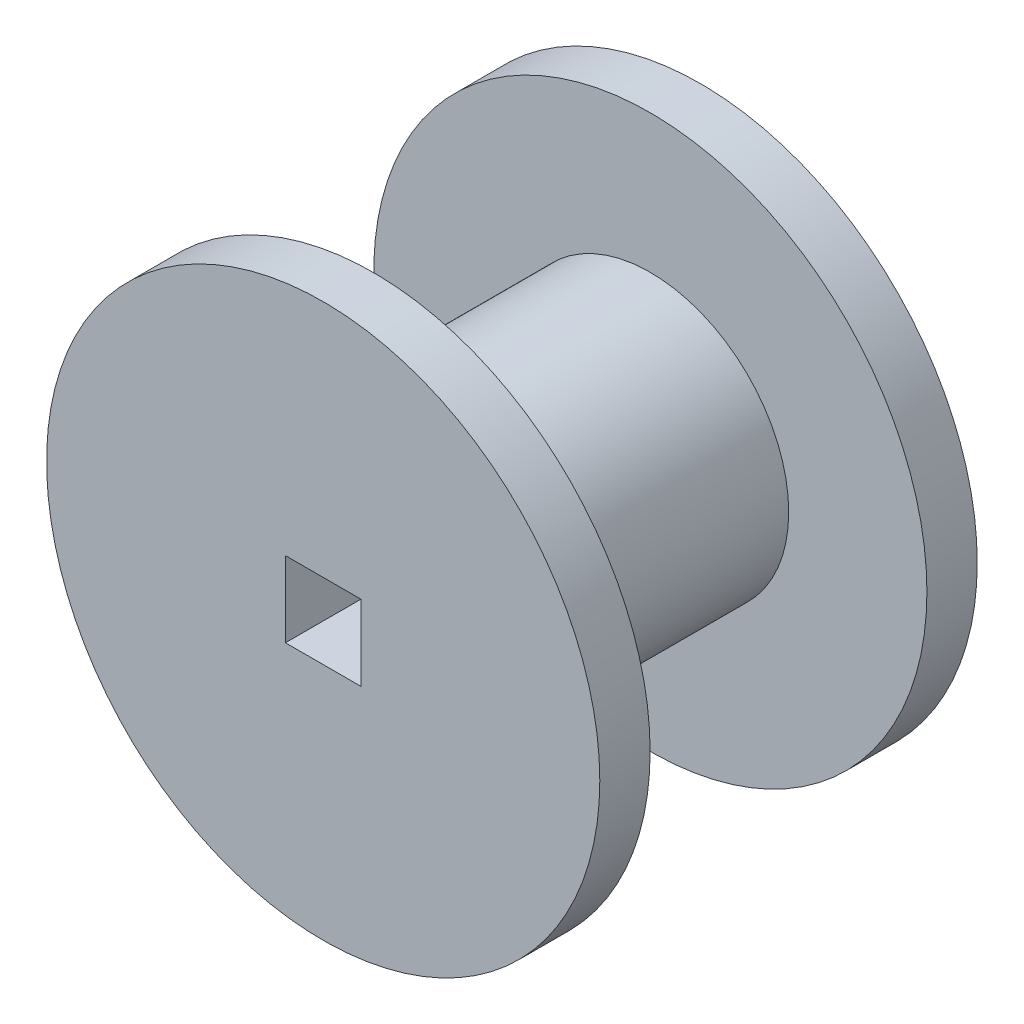
ISO-10303-21;
HEADER;
FILE_DESCRIPTION(('STEP AP214'),'2;1');
FILE_NAME('part.step','',(''),(''),'','','');
FILE_SCHEMA(('AUTOMOTIVE_DESIGN { 1 0 10303 214 1 1 1 1 }'));
ENDSEC;
DATA;
#1=APPLICATION_CONTEXT('core data for automotive mechanical design processes');
#2=APPLICATION_PROTOCOL_DEFINITION('international standard','automotive_design',2000,#1);
#3=PRODUCT_CONTEXT('',#1,'mechanical');
#4=PRODUCT('Part','Part','',(#3));
#5=PRODUCT_RELATED_PRODUCT_CATEGORY('part','',(#4));
#6=PRODUCT_DEFINITION_FORMATION('','',#4);
#7=PRODUCT_DEFINITION_CONTEXT('part definition',#1,'design');
#8=PRODUCT_DEFINITION('design','',#6,#7);
#9=PRODUCT_DEFINITION_SHAPE('','',#8);
#10=(LENGTH_UNIT() NAMED_UNIT(*) SI_UNIT(.MILLI.,.METRE.));
#11=(NAMED_UNIT(*) PLANE_ANGLE_UNIT() SI_UNIT($,.RADIAN.));
#12=(NAMED_UNIT(*) SI_UNIT($,.STERADIAN.) SOLID_ANGLE_UNIT());
#13=UNCERTAINTY_MEASURE_WITH_UNIT(LENGTH_MEASURE(1.E-05),#10,'distance_accuracy_value','');
#14=(GEOMETRIC_REPRESENTATION_CONTEXT(3) GLOBAL_UNCERTAINTY_ASSIGNED_CONTEXT((#13)) GLOBAL_UNIT_ASSIGNED_CONTEXT((#10,
#11,#12)) REPRESENTATION_CONTEXT('',''));
#15=CARTESIAN_POINT('',(0.,0.,0.));
#16=DIRECTION('',(0.,0.,1.));
#17=DIRECTION('',(1.,0.,0.));
#18=AXIS2_PLACEMENT_3D('',#15,#16,#17);
#19=CARTESIAN_POINT('',(0.,0.,2.));
#20=DIRECTION('',(0.,0.,1.));
#21=DIRECTION('',(1.,0.,0.));
#22=AXIS2_PLACEMENT_3D('',#19,#20,#21);
#23=PLANE('',#22);
#24=CARTESIAN_POINT('',(0.,0.,2.));
#25=DIRECTION('',(0.,0.,1.));
#26=DIRECTION('',(1.,0.,0.));
#27=AXIS2_PLACEMENT_3D('',#24,#25,#26);
#28=CIRCLE('',#27,10.99264862138);
#29=CARTESIAN_POINT('',(10.99264862138,0.,2.));
#30=VERTEX_POINT('',#29);
#31=EDGE_CURVE('E11',#30,#30,#28,.T.);
#32=ORIENTED_EDGE('',*,*,#31,.T.);
#33=EDGE_LOOP('',(#32));
#34=FACE_BOUND('',#33,.T.);
#35=CARTESIAN_POINT('',(0.,0.,2.));
#36=DIRECTION('',(0.,0.,1.));
#37=DIRECTION('',(1.,0.,0.));
#38=AXIS2_PLACEMENT_3D('',#35,#36,#37);
#39=CIRCLE('',#38,5.5);
#40=CARTESIAN_POINT('',(5.5,0.,2.));
#41=VERTEX_POINT('',#40);
#42=EDGE_CURVE('E121',#41,#41,#39,.T.);
#43=ORIENTED_EDGE('',*,*,#42,.F.);
#44=EDGE_LOOP('',(#43));
#45=FACE_BOUND('',#44,.T.);
#46=ADVANCED_FACE('F39',(#34,#45),#23,.T.);
#47=CARTESIAN_POINT('',(0.,0.,0.));
#48=DIRECTION('',(0.,0.,1.));
#49=DIRECTION('',(1.,0.,0.));
#50=AXIS2_PLACEMENT_3D('',#47,#48,#49);
#51=PLANE('',#50);
#52=CARTESIAN_POINT('',(0.,0.,0.));
#53=DIRECTION('',(0.,0.,1.));
#54=DIRECTION('',(1.,0.,0.));
#55=AXIS2_PLACEMENT_3D('',#52,#53,#54);
#56=CIRCLE('',#55,10.99264862138);
#57=CARTESIAN_POINT('',(10.99264862138,0.,0.));
#58=VERTEX_POINT('',#57);
#59=EDGE_CURVE('E43',#58,#58,#56,.T.);
#60=ORIENTED_EDGE('',*,*,#59,.F.);
#61=EDGE_LOOP('',(#60));
#62=FACE_BOUND('',#61,.T.);
#63=DIRECTION('',(0.,1.,0.));
#64=VECTOR('',#63,1.);
#65=CARTESIAN_POINT('',(1.5,-1.5,0.));
#66=LINE('',#65,#64);
#67=CARTESIAN_POINT('',(1.5,-1.5,0.));
#68=VERTEX_POINT('',#67);
#69=CARTESIAN_POINT('',(1.5,1.5,0.));
#70=VERTEX_POINT('',#69);
#71=EDGE_CURVE('E55',#68,#70,#66,.T.);
#72=ORIENTED_EDGE('',*,*,#71,.T.);
#73=DIRECTION('',(-1.,0.,0.));
#74=VECTOR('',#73,1.);
#75=CARTESIAN_POINT('',(-1.5,1.5,0.));
#76=LINE('',#75,#74);
#77=CARTESIAN_POINT('',(-1.5,1.5,0.));
#78=VERTEX_POINT('',#77);
#79=EDGE_CURVE('E88',#70,#78,#76,.T.);
#80=ORIENTED_EDGE('',*,*,#79,.T.);
#81=DIRECTION('',(0.,-1.,0.));
#82=VECTOR('',#81,1.);
#83=CARTESIAN_POINT('',(-1.5,-1.5,0.));
#84=LINE('',#83,#82);
#85=CARTESIAN_POINT('',(-1.5,-1.5,0.));
#86=VERTEX_POINT('',#85);
#87=EDGE_CURVE('E132',#78,#86,#84,.T.);
#88=ORIENTED_EDGE('',*,*,#87,.T.);
#89=DIRECTION('',(1.,0.,0.));
#90=VECTOR('',#89,1.);
#91=CARTESIAN_POINT('',(-1.5,-1.5,0.));
#92=LINE('',#91,#90);
#93=EDGE_CURVE('E136',#86,#68,#92,.T.);
#94=ORIENTED_EDGE('',*,*,#93,.T.);
#95=EDGE_LOOP('',(#72,#80,#88,#94));
#96=FACE_BOUND('',#95,.T.);
#97=ADVANCED_FACE('F147',(#62,#96),#51,.F.);
#98=CARTESIAN_POINT('',(0.,0.,2.));
#99=DIRECTION('',(0.,0.,-1.));
#100=DIRECTION('',(-1.,0.,0.));
#101=AXIS2_PLACEMENT_3D('',#98,#99,#100);
#102=CYLINDRICAL_SURFACE('',#101,10.99264862138);
#103=ORIENTED_EDGE('',*,*,#31,.F.);
#104=EDGE_LOOP('',(#103));
#105=FACE_BOUND('',#104,.T.);
#106=ORIENTED_EDGE('',*,*,#59,.T.);
#107=EDGE_LOOP('',(#106));
#108=FACE_BOUND('',#107,.T.);
#109=ADVANCED_FACE('F41',(#105,#108),#102,.T.);
#110=CARTESIAN_POINT('',(1.5,-1.5,2.));
#111=DIRECTION('',(-1.,0.,0.));
#112=DIRECTION('',(0.,0.,1.));
#113=AXIS2_PLACEMENT_3D('',#110,#111,#112);
#114=PLANE('',#113);
#115=ORIENTED_EDGE('',*,*,#71,.F.);
#116=DIRECTION('',(0.,0.,-1.));
#117=VECTOR('',#116,1.);
#118=CARTESIAN_POINT('',(1.5,-1.5,2.));
#119=LINE('',#118,#117);
#120=CARTESIAN_POINT('',(1.5,-1.5,15.));
#121=VERTEX_POINT('',#120);
#122=EDGE_CURVE('E102',#121,#68,#119,.T.);
#123=ORIENTED_EDGE('',*,*,#122,.F.);
#124=DIRECTION('',(0.,1.,0.));
#125=VECTOR('',#124,1.);
#126=CARTESIAN_POINT('',(1.5,-1.5,15.));
#127=LINE('',#126,#125);
#128=CARTESIAN_POINT('',(1.5,1.5,15.));
#129=VERTEX_POINT('',#128);
#130=EDGE_CURVE('E97',#121,#129,#127,.T.);
#131=ORIENTED_EDGE('',*,*,#130,.T.);
#132=DIRECTION('',(0.,0.,-1.));
#133=VECTOR('',#132,1.);
#134=CARTESIAN_POINT('',(1.5,1.5,2.));
#135=LINE('',#134,#133);
#136=EDGE_CURVE('E82',#129,#70,#135,.T.);
#137=ORIENTED_EDGE('',*,*,#136,.T.);
#138=EDGE_LOOP('',(#115,#123,#131,#137));
#139=FACE_BOUND('',#138,.T.);
#140=ADVANCED_FACE('F101',(#139),#114,.T.);
#141=CARTESIAN_POINT('',(-1.5,1.5,2.));
#142=DIRECTION('',(0.,-1.,0.));
#143=DIRECTION('',(0.,0.,-1.));
#144=AXIS2_PLACEMENT_3D('',#141,#142,#143);
#145=PLANE('',#144);
#146=ORIENTED_EDGE('',*,*,#79,.F.);
#147=ORIENTED_EDGE('',*,*,#136,.F.);
#148=DIRECTION('',(-1.,0.,0.));
#149=VECTOR('',#148,1.);
#150=CARTESIAN_POINT('',(-1.5,1.5,15.));
#151=LINE('',#150,#149);
#152=CARTESIAN_POINT('',(-1.5,1.5,15.));
#153=VERTEX_POINT('',#152);
#154=EDGE_CURVE('E85',#129,#153,#151,.T.);
#155=ORIENTED_EDGE('',*,*,#154,.T.);
#156=DIRECTION('',(0.,0.,-1.));
#157=VECTOR('',#156,1.);
#158=CARTESIAN_POINT('',(-1.5,1.5,2.));
#159=LINE('',#158,#157);
#160=EDGE_CURVE('E91',#153,#78,#159,.T.);
#161=ORIENTED_EDGE('',*,*,#160,.T.);
#162=EDGE_LOOP('',(#146,#147,#155,#161));
#163=FACE_BOUND('',#162,.T.);
#164=ADVANCED_FACE('F84',(#163),#145,.T.);
#165=CARTESIAN_POINT('',(-1.5,-1.5,2.));
#166=DIRECTION('',(1.,0.,0.));
#167=DIRECTION('',(0.,0.,-1.));
#168=AXIS2_PLACEMENT_3D('',#165,#166,#167);
#169=PLANE('',#168);
#170=ORIENTED_EDGE('',*,*,#87,.F.);
#171=ORIENTED_EDGE('',*,*,#160,.F.);
#172=DIRECTION('',(0.,-1.,0.));
#173=VECTOR('',#172,1.);
#174=CARTESIAN_POINT('',(-1.5,-1.5,15.));
#175=LINE('',#174,#173);
#176=CARTESIAN_POINT('',(-1.5,-1.5,15.));
#177=VERTEX_POINT('',#176);
#178=EDGE_CURVE('E98',#153,#177,#175,.T.);
#179=ORIENTED_EDGE('',*,*,#178,.T.);
#180=DIRECTION('',(0.,0.,-1.));
#181=VECTOR('',#180,1.);
#182=CARTESIAN_POINT('',(-1.5,-1.5,2.));
#183=LINE('',#182,#181);
#184=EDGE_CURVE('E63',#177,#86,#183,.T.);
#185=ORIENTED_EDGE('',*,*,#184,.T.);
#186=EDGE_LOOP('',(#170,#171,#179,#185));
#187=FACE_BOUND('',#186,.T.);
#188=ADVANCED_FACE('F145',(#187),#169,.T.);
#189=CARTESIAN_POINT('',(-1.5,-1.5,2.));
#190=DIRECTION('',(0.,1.,0.));
#191=DIRECTION('',(0.,0.,1.));
#192=AXIS2_PLACEMENT_3D('',#189,#190,#191);
#193=PLANE('',#192);
#194=ORIENTED_EDGE('',*,*,#93,.F.);
#195=ORIENTED_EDGE('',*,*,#184,.F.);
#196=DIRECTION('',(1.,0.,0.));
#197=VECTOR('',#196,1.);
#198=CARTESIAN_POINT('',(-1.5,-1.5,15.));
#199=LINE('',#198,#197);
#200=EDGE_CURVE('E113',#177,#121,#199,.T.);
#201=ORIENTED_EDGE('',*,*,#200,.T.);
#202=ORIENTED_EDGE('',*,*,#122,.T.);
#203=EDGE_LOOP('',(#194,#195,#201,#202));
#204=FACE_BOUND('',#203,.T.);
#205=ADVANCED_FACE('F149',(#204),#193,.T.);
#206=CARTESIAN_POINT('',(0.,0.,7.5));
#207=DIRECTION('',(0.,0.,-1.));
#208=DIRECTION('',(-1.,0.,0.));
#209=AXIS2_PLACEMENT_3D('',#206,#207,#208);
#210=CYLINDRICAL_SURFACE('',#209,5.5);
#211=ORIENTED_EDGE('',*,*,#42,.T.);
#212=EDGE_LOOP('',(#211));
#213=FACE_BOUND('',#212,.T.);
#214=CARTESIAN_POINT('',(0.,0.,13.));
#215=DIRECTION('',(0.,0.,1.));
#216=DIRECTION('',(1.,0.,0.));
#217=AXIS2_PLACEMENT_3D('',#214,#215,#216);
#218=CIRCLE('',#217,5.5);
#219=CARTESIAN_POINT('',(5.5,0.,13.));
#220=VERTEX_POINT('',#219);
#221=EDGE_CURVE('E105',#220,#220,#218,.T.);
#222=ORIENTED_EDGE('',*,*,#221,.F.);
#223=EDGE_LOOP('',(#222));
#224=FACE_BOUND('',#223,.T.);
#225=ADVANCED_FACE('F151',(#213,#224),#210,.T.);
#226=CARTESIAN_POINT('',(0.,0.,13.));
#227=DIRECTION('',(0.,0.,-1.));
#228=DIRECTION('',(1.,0.,0.));
#229=AXIS2_PLACEMENT_3D('',#226,#227,#228);
#230=PLANE('',#229);
#231=CARTESIAN_POINT('',(0.,0.,13.));
#232=DIRECTION('',(0.,0.,1.));
#233=DIRECTION('',(1.,0.,0.));
#234=AXIS2_PLACEMENT_3D('',#231,#232,#233);
#235=CIRCLE('',#234,10.99264862138);
#236=CARTESIAN_POINT('',(10.99264862138,0.,13.));
#237=VERTEX_POINT('',#236);
#238=EDGE_CURVE('E117',#237,#237,#235,.T.);
#239=ORIENTED_EDGE('',*,*,#238,.F.);
#240=EDGE_LOOP('',(#239));
#241=FACE_BOUND('',#240,.T.);
#242=ORIENTED_EDGE('',*,*,#221,.T.);
#243=EDGE_LOOP('',(#242));
#244=FACE_BOUND('',#243,.T.);
#245=ADVANCED_FACE('F157',(#241,#244),#230,.T.);
#246=CARTESIAN_POINT('',(0.,0.,15.));
#247=DIRECTION('',(0.,0.,-1.));
#248=DIRECTION('',(1.,0.,0.));
#249=AXIS2_PLACEMENT_3D('',#246,#247,#248);
#250=PLANE('',#249);
#251=CARTESIAN_POINT('',(0.,0.,15.));
#252=DIRECTION('',(0.,0.,1.));
#253=DIRECTION('',(1.,0.,0.));
#254=AXIS2_PLACEMENT_3D('',#251,#252,#253);
#255=CIRCLE('',#254,10.99264862138);
#256=CARTESIAN_POINT('',(10.99264862138,0.,15.));
#257=VERTEX_POINT('',#256);
#258=EDGE_CURVE('E116',#257,#257,#255,.T.);
#259=ORIENTED_EDGE('',*,*,#258,.T.);
#260=EDGE_LOOP('',(#259));
#261=FACE_BOUND('',#260,.T.);
#262=ORIENTED_EDGE('',*,*,#130,.F.);
#263=ORIENTED_EDGE('',*,*,#200,.F.);
#264=ORIENTED_EDGE('',*,*,#178,.F.);
#265=ORIENTED_EDGE('',*,*,#154,.F.);
#266=EDGE_LOOP('',(#262,#263,#264,#265));
#267=FACE_BOUND('',#266,.T.);
#268=ADVANCED_FACE('F95',(#261,#267),#250,.F.);
#269=CARTESIAN_POINT('',(0.,0.,13.));
#270=DIRECTION('',(0.,0.,1.));
#271=DIRECTION('',(-1.,0.,0.));
#272=AXIS2_PLACEMENT_3D('',#269,#270,#271);
#273=CYLINDRICAL_SURFACE('',#272,10.99264862138);
#274=ORIENTED_EDGE('',*,*,#238,.T.);
#275=EDGE_LOOP('',(#274));
#276=FACE_BOUND('',#275,.T.);
#277=ORIENTED_EDGE('',*,*,#258,.F.);
#278=EDGE_LOOP('',(#277));
#279=FACE_BOUND('',#278,.T.);
#280=ADVANCED_FACE('F212',(#276,#279),#273,.T.);
#281=CLOSED_SHELL('',(#46,#97,#109,#140,#164,#188,#205,#225,#245,#268,#280));
#282=MANIFOLD_SOLID_BREP('B2',#281);
#283=ADVANCED_BREP_SHAPE_REPRESENTATION('',(#18,#282),#14);
#284=SHAPE_DEFINITION_REPRESENTATION(#9,#283);
ENDSEC;
END-ISO-10303-21;
